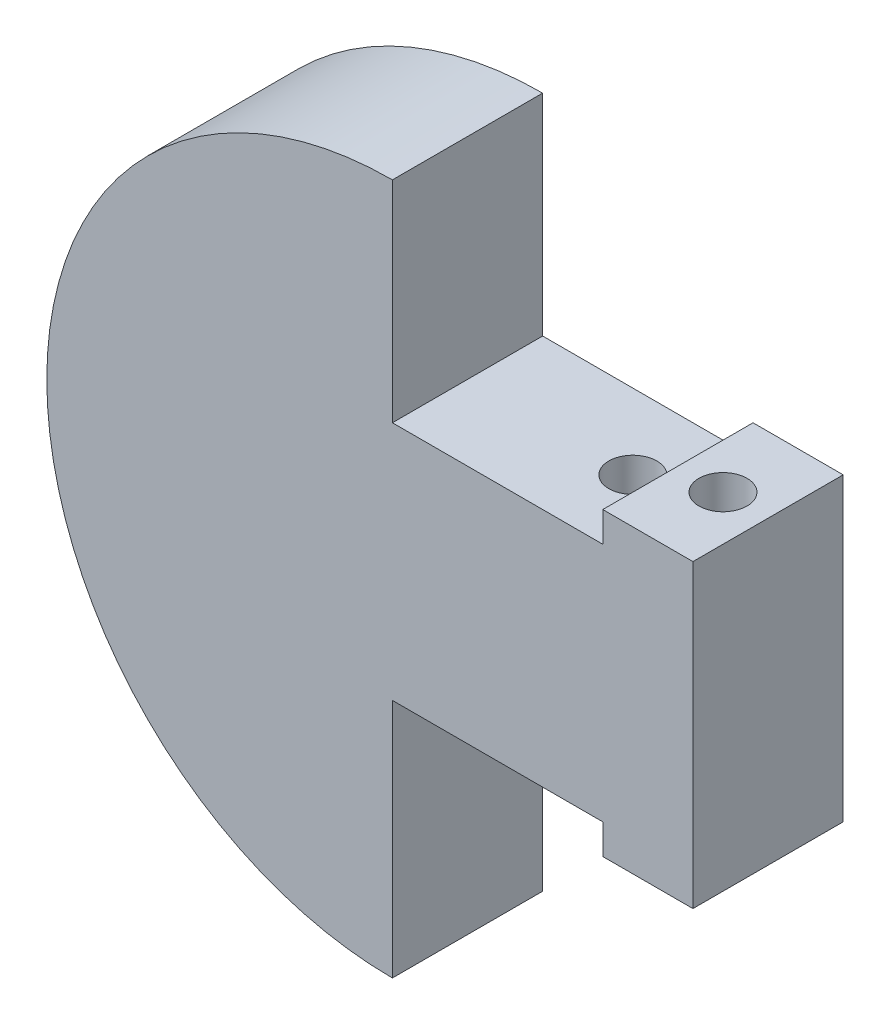
ISO-10303-21;
HEADER;
FILE_DESCRIPTION(('STEP AP214'),'2;1');
FILE_NAME('part.step','',(''),(''),'','','');
FILE_SCHEMA(('AUTOMOTIVE_DESIGN { 1 0 10303 214 1 1 1 1 }'));
ENDSEC;
DATA;
#1=APPLICATION_CONTEXT('core data for automotive mechanical design processes');
#2=APPLICATION_PROTOCOL_DEFINITION('international standard','automotive_design',2000,#1);
#3=PRODUCT_CONTEXT('',#1,'mechanical');
#4=PRODUCT('Part','Part','',(#3));
#5=PRODUCT_RELATED_PRODUCT_CATEGORY('part','',(#4));
#6=PRODUCT_DEFINITION_FORMATION('','',#4);
#7=PRODUCT_DEFINITION_CONTEXT('part definition',#1,'design');
#8=PRODUCT_DEFINITION('design','',#6,#7);
#9=PRODUCT_DEFINITION_SHAPE('','',#8);
#10=(LENGTH_UNIT() NAMED_UNIT(*) SI_UNIT(.MILLI.,.METRE.));
#11=(NAMED_UNIT(*) PLANE_ANGLE_UNIT() SI_UNIT($,.RADIAN.));
#12=(NAMED_UNIT(*) SI_UNIT($,.STERADIAN.) SOLID_ANGLE_UNIT());
#13=UNCERTAINTY_MEASURE_WITH_UNIT(LENGTH_MEASURE(1.E-05),#10,'distance_accuracy_value','');
#14=(GEOMETRIC_REPRESENTATION_CONTEXT(3) GLOBAL_UNCERTAINTY_ASSIGNED_CONTEXT((#13)) GLOBAL_UNIT_ASSIGNED_CONTEXT((#10,
#11,#12)) REPRESENTATION_CONTEXT('',''));
#15=CARTESIAN_POINT('',(0.,0.,0.));
#16=DIRECTION('',(0.,0.,1.));
#17=DIRECTION('',(1.,0.,0.));
#18=AXIS2_PLACEMENT_3D('',#15,#16,#17);
#19=CARTESIAN_POINT('',(10.,6.,5.));
#20=DIRECTION('',(-1.,0.,0.));
#21=DIRECTION('',(0.,0.,1.));
#22=AXIS2_PLACEMENT_3D('',#19,#20,#21);
#23=PLANE('',#22);
#24=DIRECTION('',(0.,1.,0.));
#25=VECTOR('',#24,1.);
#26=CARTESIAN_POINT('',(10.,6.,0.));
#27=LINE('',#26,#25);
#28=CARTESIAN_POINT('',(10.,-4.,0.));
#29=VERTEX_POINT('',#28);
#30=CARTESIAN_POINT('',(10.,6.,0.));
#31=VERTEX_POINT('',#30);
#32=EDGE_CURVE('E143',#29,#31,#27,.T.);
#33=ORIENTED_EDGE('',*,*,#32,.T.);
#34=DIRECTION('',(0.,0.,-1.));
#35=VECTOR('',#34,1.);
#36=CARTESIAN_POINT('',(10.,6.,5.));
#37=LINE('',#36,#35);
#38=CARTESIAN_POINT('',(10.,6.,5.));
#39=VERTEX_POINT('',#38);
#40=EDGE_CURVE('E11',#39,#31,#37,.T.);
#41=ORIENTED_EDGE('',*,*,#40,.F.);
#42=DIRECTION('',(0.,1.,0.));
#43=VECTOR('',#42,1.);
#44=CARTESIAN_POINT('',(10.,6.,5.));
#45=LINE('',#44,#43);
#46=CARTESIAN_POINT('',(10.,-4.,5.));
#47=VERTEX_POINT('',#46);
#48=EDGE_CURVE('E162',#47,#39,#45,.T.);
#49=ORIENTED_EDGE('',*,*,#48,.F.);
#50=DIRECTION('',(0.,0.,-1.));
#51=VECTOR('',#50,1.);
#52=CARTESIAN_POINT('',(10.,-4.,5.));
#53=LINE('',#52,#51);
#54=EDGE_CURVE('E139',#47,#29,#53,.T.);
#55=ORIENTED_EDGE('',*,*,#54,.T.);
#56=EDGE_LOOP('',(#33,#41,#49,#55));
#57=FACE_BOUND('',#56,.T.);
#58=ADVANCED_FACE('F33',(#57),#23,.F.);
#59=CARTESIAN_POINT('',(10.,6.,5.));
#60=DIRECTION('',(0.,-1.,0.));
#61=DIRECTION('',(0.,0.,-1.));
#62=AXIS2_PLACEMENT_3D('',#59,#60,#61);
#63=PLANE('',#62);
#64=CARTESIAN_POINT('',(8.5,6.,2.5));
#65=DIRECTION('',(0.,-1.,0.));
#66=DIRECTION('',(0.,0.,-1.));
#67=AXIS2_PLACEMENT_3D('',#64,#65,#66);
#68=CIRCLE('',#67,0.799999999999999);
#69=CARTESIAN_POINT('',(8.5,6.,1.7));
#70=VERTEX_POINT('',#69);
#71=EDGE_CURVE('E147',#70,#70,#68,.T.);
#72=ORIENTED_EDGE('',*,*,#71,.T.);
#73=EDGE_LOOP('',(#72));
#74=FACE_BOUND('',#73,.T.);
#75=DIRECTION('',(-1.,0.,0.));
#76=VECTOR('',#75,1.);
#77=CARTESIAN_POINT('',(10.,6.,0.));
#78=LINE('',#77,#76);
#79=CARTESIAN_POINT('',(7.,6.,0.));
#80=VERTEX_POINT('',#79);
#81=EDGE_CURVE('E146',#31,#80,#78,.T.);
#82=ORIENTED_EDGE('',*,*,#81,.T.);
#83=DIRECTION('',(0.,0.,-1.));
#84=VECTOR('',#83,1.);
#85=CARTESIAN_POINT('',(7.,6.,5.));
#86=LINE('',#85,#84);
#87=CARTESIAN_POINT('',(7.,6.,5.));
#88=VERTEX_POINT('',#87);
#89=EDGE_CURVE('E42',#88,#80,#86,.T.);
#90=ORIENTED_EDGE('',*,*,#89,.F.);
#91=DIRECTION('',(-1.,0.,0.));
#92=VECTOR('',#91,1.);
#93=CARTESIAN_POINT('',(10.,6.,5.));
#94=LINE('',#93,#92);
#95=EDGE_CURVE('E100',#39,#88,#94,.T.);
#96=ORIENTED_EDGE('',*,*,#95,.F.);
#97=ORIENTED_EDGE('',*,*,#40,.T.);
#98=EDGE_LOOP('',(#82,#90,#96,#97));
#99=FACE_BOUND('',#98,.T.);
#100=ADVANCED_FACE('F229',(#74,#99),#63,.F.);
#101=CARTESIAN_POINT('',(7.,6.,5.));
#102=DIRECTION('',(1.,0.,0.));
#103=DIRECTION('',(0.,0.,-1.));
#104=AXIS2_PLACEMENT_3D('',#101,#102,#103);
#105=PLANE('',#104);
#106=DIRECTION('',(0.,-1.,0.));
#107=VECTOR('',#106,1.);
#108=CARTESIAN_POINT('',(7.,6.,0.));
#109=LINE('',#108,#107);
#110=CARTESIAN_POINT('',(7.,5.,0.));
#111=VERTEX_POINT('',#110);
#112=EDGE_CURVE('E149',#80,#111,#109,.T.);
#113=ORIENTED_EDGE('',*,*,#112,.T.);
#114=DIRECTION('',(0.,0.,-1.));
#115=VECTOR('',#114,1.);
#116=CARTESIAN_POINT('',(7.,5.,5.));
#117=LINE('',#116,#115);
#118=CARTESIAN_POINT('',(7.,5.,5.));
#119=VERTEX_POINT('',#118);
#120=EDGE_CURVE('E175',#119,#111,#117,.T.);
#121=ORIENTED_EDGE('',*,*,#120,.F.);
#122=DIRECTION('',(0.,-1.,0.));
#123=VECTOR('',#122,1.);
#124=CARTESIAN_POINT('',(7.,6.,5.));
#125=LINE('',#124,#123);
#126=EDGE_CURVE('E194',#88,#119,#125,.T.);
#127=ORIENTED_EDGE('',*,*,#126,.F.);
#128=ORIENTED_EDGE('',*,*,#89,.T.);
#129=EDGE_LOOP('',(#113,#121,#127,#128));
#130=FACE_BOUND('',#129,.T.);
#131=ADVANCED_FACE('F233',(#130),#105,.F.);
#132=CARTESIAN_POINT('',(0.,5.,5.));
#133=DIRECTION('',(0.,-1.,0.));
#134=DIRECTION('',(0.,0.,-1.));
#135=AXIS2_PLACEMENT_3D('',#132,#133,#134);
#136=PLANE('',#135);
#137=CARTESIAN_POINT('',(5.5,5.,2.5));
#138=DIRECTION('',(0.,-1.,0.));
#139=DIRECTION('',(0.,0.,-1.));
#140=AXIS2_PLACEMENT_3D('',#137,#138,#139);
#141=CIRCLE('',#140,0.8);
#142=CARTESIAN_POINT('',(5.5,5.,1.7));
#143=VERTEX_POINT('',#142);
#144=EDGE_CURVE('E181',#143,#143,#141,.T.);
#145=ORIENTED_EDGE('',*,*,#144,.T.);
#146=EDGE_LOOP('',(#145));
#147=FACE_BOUND('',#146,.T.);
#148=DIRECTION('',(-1.,0.,0.));
#149=VECTOR('',#148,1.);
#150=CARTESIAN_POINT('',(0.,5.,0.));
#151=LINE('',#150,#149);
#152=CARTESIAN_POINT('',(0.,5.,0.));
#153=VERTEX_POINT('',#152);
#154=EDGE_CURVE('E151',#111,#153,#151,.T.);
#155=ORIENTED_EDGE('',*,*,#154,.T.);
#156=DIRECTION('',(0.,0.,-1.));
#157=VECTOR('',#156,1.);
#158=CARTESIAN_POINT('',(0.,5.,5.));
#159=LINE('',#158,#157);
#160=CARTESIAN_POINT('',(0.,5.,5.));
#161=VERTEX_POINT('',#160);
#162=EDGE_CURVE('E172',#161,#153,#159,.T.);
#163=ORIENTED_EDGE('',*,*,#162,.F.);
#164=DIRECTION('',(-1.,0.,0.));
#165=VECTOR('',#164,1.);
#166=CARTESIAN_POINT('',(0.,5.,5.));
#167=LINE('',#166,#165);
#168=EDGE_CURVE('E196',#119,#161,#167,.T.);
#169=ORIENTED_EDGE('',*,*,#168,.F.);
#170=ORIENTED_EDGE('',*,*,#120,.T.);
#171=EDGE_LOOP('',(#155,#163,#169,#170));
#172=FACE_BOUND('',#171,.T.);
#173=ADVANCED_FACE('F238',(#147,#172),#136,.F.);
#174=CARTESIAN_POINT('',(0.,12.,5.));
#175=DIRECTION('',(-1.,0.,0.));
#176=DIRECTION('',(0.,0.,1.));
#177=AXIS2_PLACEMENT_3D('',#174,#175,#176);
#178=PLANE('',#177);
#179=DIRECTION('',(0.,1.,0.));
#180=VECTOR('',#179,1.);
#181=CARTESIAN_POINT('',(0.,12.,0.));
#182=LINE('',#181,#180);
#183=CARTESIAN_POINT('',(0.,12.,0.));
#184=VERTEX_POINT('',#183);
#185=EDGE_CURVE('E153',#153,#184,#182,.T.);
#186=ORIENTED_EDGE('',*,*,#185,.T.);
#187=DIRECTION('',(0.,0.,-1.));
#188=VECTOR('',#187,1.);
#189=CARTESIAN_POINT('',(0.,12.,5.));
#190=LINE('',#189,#188);
#191=CARTESIAN_POINT('',(0.,12.,5.));
#192=VERTEX_POINT('',#191);
#193=EDGE_CURVE('E169',#192,#184,#190,.T.);
#194=ORIENTED_EDGE('',*,*,#193,.F.);
#195=DIRECTION('',(0.,1.,0.));
#196=VECTOR('',#195,1.);
#197=CARTESIAN_POINT('',(0.,12.,5.));
#198=LINE('',#197,#196);
#199=EDGE_CURVE('E198',#161,#192,#198,.T.);
#200=ORIENTED_EDGE('',*,*,#199,.F.);
#201=ORIENTED_EDGE('',*,*,#162,.T.);
#202=EDGE_LOOP('',(#186,#194,#200,#201));
#203=FACE_BOUND('',#202,.T.);
#204=ADVANCED_FACE('F244',(#203),#178,.F.);
#205=CARTESIAN_POINT('',(0.,0.5,5.));
#206=DIRECTION('',(0.,0.,-1.));
#207=DIRECTION('',(-1.,0.,0.));
#208=AXIS2_PLACEMENT_3D('',#205,#206,#207);
#209=CYLINDRICAL_SURFACE('',#208,11.5);
#210=CARTESIAN_POINT('',(0.,0.5,0.));
#211=DIRECTION('',(0.,0.,1.));
#212=DIRECTION('',(1.,0.,0.));
#213=AXIS2_PLACEMENT_3D('',#210,#211,#212);
#214=CIRCLE('',#213,11.5);
#215=CARTESIAN_POINT('',(0.,-11.,0.));
#216=VERTEX_POINT('',#215);
#217=EDGE_CURVE('E155',#184,#216,#214,.T.);
#218=ORIENTED_EDGE('',*,*,#217,.T.);
#219=DIRECTION('',(0.,0.,-1.));
#220=VECTOR('',#219,1.);
#221=CARTESIAN_POINT('',(0.,-11.,5.));
#222=LINE('',#221,#220);
#223=CARTESIAN_POINT('',(0.,-11.,5.));
#224=VERTEX_POINT('',#223);
#225=EDGE_CURVE('E166',#224,#216,#222,.T.);
#226=ORIENTED_EDGE('',*,*,#225,.F.);
#227=CARTESIAN_POINT('',(0.,0.5,5.));
#228=DIRECTION('',(0.,0.,1.));
#229=DIRECTION('',(1.,0.,0.));
#230=AXIS2_PLACEMENT_3D('',#227,#228,#229);
#231=CIRCLE('',#230,11.5);
#232=EDGE_CURVE('E200',#192,#224,#231,.T.);
#233=ORIENTED_EDGE('',*,*,#232,.F.);
#234=ORIENTED_EDGE('',*,*,#193,.T.);
#235=EDGE_LOOP('',(#218,#226,#233,#234));
#236=FACE_BOUND('',#235,.T.);
#237=ADVANCED_FACE('F206',(#236),#209,.T.);
#238=CARTESIAN_POINT('',(0.,-11.,5.));
#239=DIRECTION('',(-1.,0.,0.));
#240=DIRECTION('',(0.,0.,1.));
#241=AXIS2_PLACEMENT_3D('',#238,#239,#240);
#242=PLANE('',#241);
#243=DIRECTION('',(0.,1.,0.));
#244=VECTOR('',#243,1.);
#245=CARTESIAN_POINT('',(0.,-11.,0.));
#246=LINE('',#245,#244);
#247=CARTESIAN_POINT('',(0.,-3.,0.));
#248=VERTEX_POINT('',#247);
#249=EDGE_CURVE('E157',#216,#248,#246,.T.);
#250=ORIENTED_EDGE('',*,*,#249,.T.);
#251=DIRECTION('',(0.,0.,-1.));
#252=VECTOR('',#251,1.);
#253=CARTESIAN_POINT('',(0.,-3.,5.));
#254=LINE('',#253,#252);
#255=CARTESIAN_POINT('',(0.,-3.,5.));
#256=VERTEX_POINT('',#255);
#257=EDGE_CURVE('E134',#256,#248,#254,.T.);
#258=ORIENTED_EDGE('',*,*,#257,.F.);
#259=DIRECTION('',(0.,1.,0.));
#260=VECTOR('',#259,1.);
#261=CARTESIAN_POINT('',(0.,-11.,5.));
#262=LINE('',#261,#260);
#263=EDGE_CURVE('E125',#224,#256,#262,.T.);
#264=ORIENTED_EDGE('',*,*,#263,.F.);
#265=ORIENTED_EDGE('',*,*,#225,.T.);
#266=EDGE_LOOP('',(#250,#258,#264,#265));
#267=FACE_BOUND('',#266,.T.);
#268=ADVANCED_FACE('F210',(#267),#242,.F.);
#269=CARTESIAN_POINT('',(0.,-3.,5.));
#270=DIRECTION('',(0.,1.,0.));
#271=DIRECTION('',(0.,0.,1.));
#272=AXIS2_PLACEMENT_3D('',#269,#270,#271);
#273=PLANE('',#272);
#274=CARTESIAN_POINT('',(5.5,-3.,2.5));
#275=DIRECTION('',(0.,1.,0.));
#276=DIRECTION('',(0.,0.,1.));
#277=AXIS2_PLACEMENT_3D('',#274,#275,#276);
#278=CIRCLE('',#277,0.8);
#279=CARTESIAN_POINT('',(5.5,-3.,3.3));
#280=VERTEX_POINT('',#279);
#281=EDGE_CURVE('E36',#280,#280,#278,.T.);
#282=ORIENTED_EDGE('',*,*,#281,.T.);
#283=EDGE_LOOP('',(#282));
#284=FACE_BOUND('',#283,.T.);
#285=DIRECTION('',(1.,0.,0.));
#286=VECTOR('',#285,1.);
#287=CARTESIAN_POINT('',(0.,-3.,0.));
#288=LINE('',#287,#286);
#289=CARTESIAN_POINT('',(7.,-3.,0.));
#290=VERTEX_POINT('',#289);
#291=EDGE_CURVE('E133',#248,#290,#288,.T.);
#292=ORIENTED_EDGE('',*,*,#291,.T.);
#293=DIRECTION('',(0.,0.,-1.));
#294=VECTOR('',#293,1.);
#295=CARTESIAN_POINT('',(7.,-3.,5.));
#296=LINE('',#295,#294);
#297=CARTESIAN_POINT('',(7.,-3.,5.));
#298=VERTEX_POINT('',#297);
#299=EDGE_CURVE('E130',#298,#290,#296,.T.);
#300=ORIENTED_EDGE('',*,*,#299,.F.);
#301=DIRECTION('',(1.,0.,0.));
#302=VECTOR('',#301,1.);
#303=CARTESIAN_POINT('',(0.,-3.,5.));
#304=LINE('',#303,#302);
#305=EDGE_CURVE('E119',#256,#298,#304,.T.);
#306=ORIENTED_EDGE('',*,*,#305,.F.);
#307=ORIENTED_EDGE('',*,*,#257,.T.);
#308=EDGE_LOOP('',(#292,#300,#306,#307));
#309=FACE_BOUND('',#308,.T.);
#310=ADVANCED_FACE('F131',(#284,#309),#273,.F.);
#311=CARTESIAN_POINT('',(7.,-3.,5.));
#312=DIRECTION('',(1.,0.,0.));
#313=DIRECTION('',(0.,0.,-1.));
#314=AXIS2_PLACEMENT_3D('',#311,#312,#313);
#315=PLANE('',#314);
#316=DIRECTION('',(0.,-1.,0.));
#317=VECTOR('',#316,1.);
#318=CARTESIAN_POINT('',(7.,-3.,0.));
#319=LINE('',#318,#317);
#320=CARTESIAN_POINT('',(7.,-4.,0.));
#321=VERTEX_POINT('',#320);
#322=EDGE_CURVE('E86',#290,#321,#319,.T.);
#323=ORIENTED_EDGE('',*,*,#322,.T.);
#324=DIRECTION('',(0.,0.,-1.));
#325=VECTOR('',#324,1.);
#326=CARTESIAN_POINT('',(7.,-4.,5.));
#327=LINE('',#326,#325);
#328=CARTESIAN_POINT('',(7.,-4.,5.));
#329=VERTEX_POINT('',#328);
#330=EDGE_CURVE('E135',#329,#321,#327,.T.);
#331=ORIENTED_EDGE('',*,*,#330,.F.);
#332=DIRECTION('',(0.,-1.,0.));
#333=VECTOR('',#332,1.);
#334=CARTESIAN_POINT('',(7.,-3.,5.));
#335=LINE('',#334,#333);
#336=EDGE_CURVE('E123',#298,#329,#335,.T.);
#337=ORIENTED_EDGE('',*,*,#336,.F.);
#338=ORIENTED_EDGE('',*,*,#299,.T.);
#339=EDGE_LOOP('',(#323,#331,#337,#338));
#340=FACE_BOUND('',#339,.T.);
#341=ADVANCED_FACE('F137',(#340),#315,.F.);
#342=CARTESIAN_POINT('',(7.,-4.,5.));
#343=DIRECTION('',(0.,1.,0.));
#344=DIRECTION('',(0.,0.,1.));
#345=AXIS2_PLACEMENT_3D('',#342,#343,#344);
#346=PLANE('',#345);
#347=CARTESIAN_POINT('',(8.5,-4.,2.5));
#348=DIRECTION('',(0.,1.,0.));
#349=DIRECTION('',(0.,0.,1.));
#350=AXIS2_PLACEMENT_3D('',#347,#348,#349);
#351=CIRCLE('',#350,0.799999999999999);
#352=CARTESIAN_POINT('',(8.5,-4.,3.3));
#353=VERTEX_POINT('',#352);
#354=EDGE_CURVE('E179',#353,#353,#351,.T.);
#355=ORIENTED_EDGE('',*,*,#354,.T.);
#356=EDGE_LOOP('',(#355));
#357=FACE_BOUND('',#356,.T.);
#358=DIRECTION('',(1.,0.,0.));
#359=VECTOR('',#358,1.);
#360=CARTESIAN_POINT('',(7.,-4.,0.));
#361=LINE('',#360,#359);
#362=EDGE_CURVE('E92',#321,#29,#361,.T.);
#363=ORIENTED_EDGE('',*,*,#362,.T.);
#364=ORIENTED_EDGE('',*,*,#54,.F.);
#365=DIRECTION('',(1.,0.,0.));
#366=VECTOR('',#365,1.);
#367=CARTESIAN_POINT('',(7.,-4.,5.));
#368=LINE('',#367,#366);
#369=EDGE_CURVE('E51',#329,#47,#368,.T.);
#370=ORIENTED_EDGE('',*,*,#369,.F.);
#371=ORIENTED_EDGE('',*,*,#330,.T.);
#372=EDGE_LOOP('',(#363,#364,#370,#371));
#373=FACE_BOUND('',#372,.T.);
#374=ADVANCED_FACE('F218',(#357,#373),#346,.F.);
#375=CARTESIAN_POINT('',(0.,0.5,5.));
#376=DIRECTION('',(0.,0.,1.));
#377=DIRECTION('',(1.,0.,0.));
#378=AXIS2_PLACEMENT_3D('',#375,#376,#377);
#379=PLANE('',#378);
#380=ORIENTED_EDGE('',*,*,#48,.T.);
#381=ORIENTED_EDGE('',*,*,#95,.T.);
#382=ORIENTED_EDGE('',*,*,#126,.T.);
#383=ORIENTED_EDGE('',*,*,#168,.T.);
#384=ORIENTED_EDGE('',*,*,#199,.T.);
#385=ORIENTED_EDGE('',*,*,#232,.T.);
#386=ORIENTED_EDGE('',*,*,#263,.T.);
#387=ORIENTED_EDGE('',*,*,#305,.T.);
#388=ORIENTED_EDGE('',*,*,#336,.T.);
#389=ORIENTED_EDGE('',*,*,#369,.T.);
#390=EDGE_LOOP('',(#380,#381,#382,#383,#384,#385,#386,#387,#388,#389));
#391=FACE_BOUND('',#390,.T.);
#392=ADVANCED_FACE('F121',(#391),#379,.T.);
#393=CARTESIAN_POINT('',(0.,0.5,0.));
#394=DIRECTION('',(0.,0.,1.));
#395=DIRECTION('',(1.,0.,0.));
#396=AXIS2_PLACEMENT_3D('',#393,#394,#395);
#397=PLANE('',#396);
#398=ORIENTED_EDGE('',*,*,#32,.F.);
#399=ORIENTED_EDGE('',*,*,#362,.F.);
#400=ORIENTED_EDGE('',*,*,#322,.F.);
#401=ORIENTED_EDGE('',*,*,#291,.F.);
#402=ORIENTED_EDGE('',*,*,#249,.F.);
#403=ORIENTED_EDGE('',*,*,#217,.F.);
#404=ORIENTED_EDGE('',*,*,#185,.F.);
#405=ORIENTED_EDGE('',*,*,#154,.F.);
#406=ORIENTED_EDGE('',*,*,#112,.F.);
#407=ORIENTED_EDGE('',*,*,#81,.F.);
#408=EDGE_LOOP('',(#398,#399,#400,#401,#402,#403,#404,#405,#406,#407));
#409=FACE_BOUND('',#408,.T.);
#410=ADVANCED_FACE('F213',(#409),#397,.F.);
#411=CARTESIAN_POINT('',(8.5,-11.,2.5));
#412=DIRECTION('',(0.,1.,0.));
#413=DIRECTION('',(0.,0.,1.));
#414=AXIS2_PLACEMENT_3D('',#411,#412,#413);
#415=CYLINDRICAL_SURFACE('',#414,0.799999999999999);
#416=ORIENTED_EDGE('',*,*,#354,.F.);
#417=EDGE_LOOP('',(#416));
#418=FACE_BOUND('',#417,.T.);
#419=ORIENTED_EDGE('',*,*,#71,.F.);
#420=EDGE_LOOP('',(#419));
#421=FACE_BOUND('',#420,.T.);
#422=ADVANCED_FACE('F261',(#418,#421),#415,.F.);
#423=CARTESIAN_POINT('',(5.5,-11.,2.5));
#424=DIRECTION('',(0.,1.,0.));
#425=DIRECTION('',(0.,0.,1.));
#426=AXIS2_PLACEMENT_3D('',#423,#424,#425);
#427=CYLINDRICAL_SURFACE('',#426,0.8);
#428=ORIENTED_EDGE('',*,*,#281,.F.);
#429=EDGE_LOOP('',(#428));
#430=FACE_BOUND('',#429,.T.);
#431=ORIENTED_EDGE('',*,*,#144,.F.);
#432=EDGE_LOOP('',(#431));
#433=FACE_BOUND('',#432,.T.);
#434=ADVANCED_FACE('F258',(#430,#433),#427,.F.);
#435=CLOSED_SHELL('',(#58,#100,#131,#173,#204,#237,#268,#310,#341,#374,#392,#410,#422,#434));
#436=MANIFOLD_SOLID_BREP('B2',#435);
#437=ADVANCED_BREP_SHAPE_REPRESENTATION('',(#18,#436),#14);
#438=SHAPE_DEFINITION_REPRESENTATION(#9,#437);
ENDSEC;
END-ISO-10303-21;
